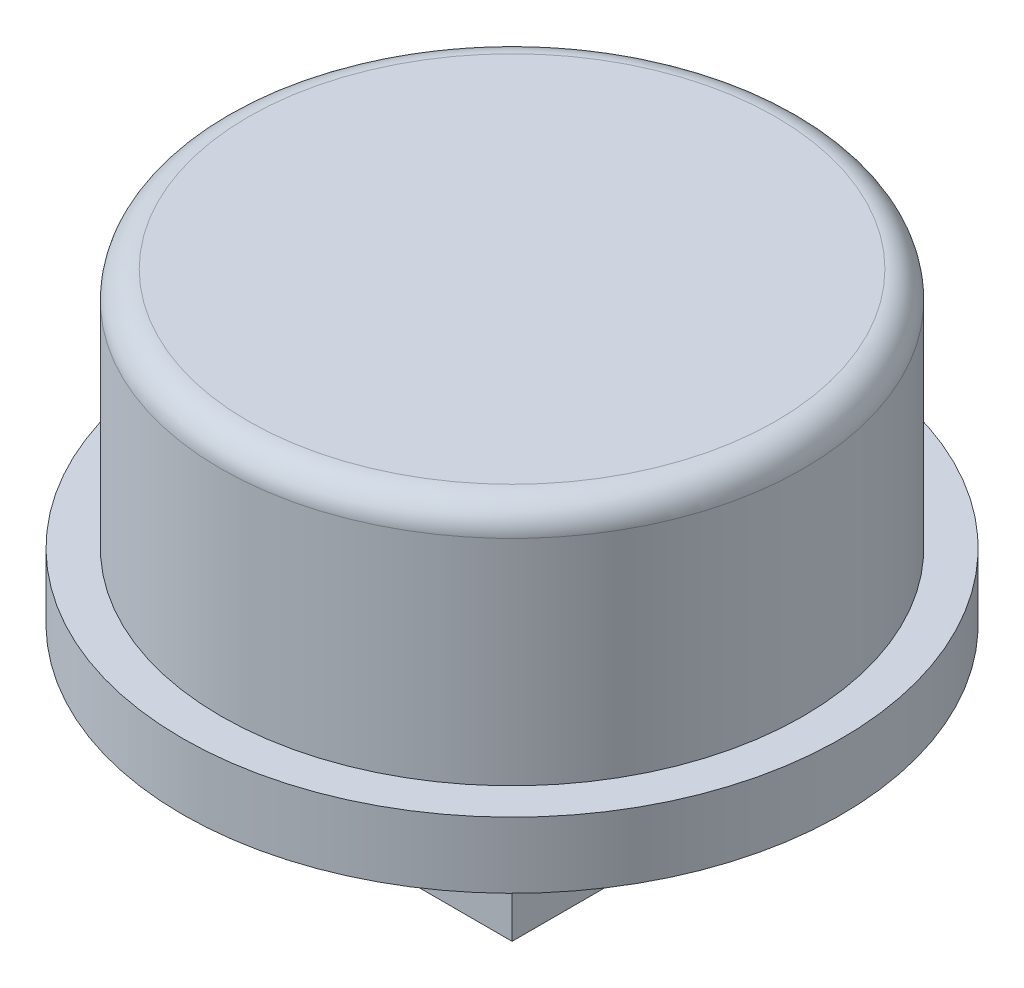
ISO-10303-21;
HEADER;
FILE_DESCRIPTION(('STEP AP214'),'2;1');
FILE_NAME('part.step','',(''),(''),'','','');
FILE_SCHEMA(('AUTOMOTIVE_DESIGN { 1 0 10303 214 1 1 1 1 }'));
ENDSEC;
DATA;
#1=APPLICATION_CONTEXT('core data for automotive mechanical design processes');
#2=APPLICATION_PROTOCOL_DEFINITION('international standard','automotive_design',2000,#1);
#3=PRODUCT_CONTEXT('',#1,'mechanical');
#4=PRODUCT('Part','Part','',(#3));
#5=PRODUCT_RELATED_PRODUCT_CATEGORY('part','',(#4));
#6=PRODUCT_DEFINITION_FORMATION('','',#4);
#7=PRODUCT_DEFINITION_CONTEXT('part definition',#1,'design');
#8=PRODUCT_DEFINITION('design','',#6,#7);
#9=PRODUCT_DEFINITION_SHAPE('','',#8);
#10=(LENGTH_UNIT() NAMED_UNIT(*) SI_UNIT(.MILLI.,.METRE.));
#11=(NAMED_UNIT(*) PLANE_ANGLE_UNIT() SI_UNIT($,.RADIAN.));
#12=(NAMED_UNIT(*) SI_UNIT($,.STERADIAN.) SOLID_ANGLE_UNIT());
#13=UNCERTAINTY_MEASURE_WITH_UNIT(LENGTH_MEASURE(1.E-05),#10,'distance_accuracy_value','');
#14=(GEOMETRIC_REPRESENTATION_CONTEXT(3) GLOBAL_UNCERTAINTY_ASSIGNED_CONTEXT((#13)) GLOBAL_UNIT_ASSIGNED_CONTEXT((#10,
#11,#12)) REPRESENTATION_CONTEXT('',''));
#15=CARTESIAN_POINT('',(0.,0.,0.));
#16=DIRECTION('',(0.,0.,1.));
#17=DIRECTION('',(1.,0.,0.));
#18=AXIS2_PLACEMENT_3D('',#15,#16,#17);
#19=CARTESIAN_POINT('',(0.,0.,0.));
#20=DIRECTION('',(0.,1.,0.));
#21=DIRECTION('',(0.,0.,1.));
#22=AXIS2_PLACEMENT_3D('',#19,#20,#21);
#23=PLANE('',#22);
#24=CARTESIAN_POINT('',(0.,0.,0.));
#25=DIRECTION('',(0.,1.,0.));
#26=DIRECTION('',(0.,0.,1.));
#27=AXIS2_PLACEMENT_3D('',#24,#25,#26);
#28=CIRCLE('',#27,6.);
#29=CARTESIAN_POINT('',(0.,0.,6.));
#30=VERTEX_POINT('',#29);
#31=EDGE_CURVE('E209',#30,#30,#28,.T.);
#32=ORIENTED_EDGE('',*,*,#31,.F.);
#33=EDGE_LOOP('',(#32));
#34=FACE_BOUND('',#33,.T.);
#35=DIRECTION('',(0.,0.,1.));
#36=VECTOR('',#35,1.);
#37=CARTESIAN_POINT('',(2.5,0.,-2.5));
#38=LINE('',#37,#36);
#39=CARTESIAN_POINT('',(2.5,0.,-2.5));
#40=VERTEX_POINT('',#39);
#41=CARTESIAN_POINT('',(2.5,0.,2.5));
#42=VERTEX_POINT('',#41);
#43=EDGE_CURVE('E128',#40,#42,#38,.T.);
#44=ORIENTED_EDGE('',*,*,#43,.F.);
#45=DIRECTION('',(1.,0.,0.));
#46=VECTOR('',#45,1.);
#47=CARTESIAN_POINT('',(-2.5,0.,-2.5));
#48=LINE('',#47,#46);
#49=CARTESIAN_POINT('',(-2.5,0.,-2.5));
#50=VERTEX_POINT('',#49);
#51=EDGE_CURVE('E167',#50,#40,#48,.T.);
#52=ORIENTED_EDGE('',*,*,#51,.F.);
#53=DIRECTION('',(0.,0.,-1.));
#54=VECTOR('',#53,1.);
#55=CARTESIAN_POINT('',(-2.5,0.,-2.5));
#56=LINE('',#55,#54);
#57=CARTESIAN_POINT('',(-2.5,0.,2.5));
#58=VERTEX_POINT('',#57);
#59=EDGE_CURVE('E64',#58,#50,#56,.T.);
#60=ORIENTED_EDGE('',*,*,#59,.F.);
#61=DIRECTION('',(-1.,0.,0.));
#62=VECTOR('',#61,1.);
#63=CARTESIAN_POINT('',(-2.5,0.,2.5));
#64=LINE('',#63,#62);
#65=EDGE_CURVE('E59',#42,#58,#64,.T.);
#66=ORIENTED_EDGE('',*,*,#65,.F.);
#67=EDGE_LOOP('',(#44,#52,#60,#66));
#68=FACE_BOUND('',#67,.T.);
#69=ADVANCED_FACE('F43',(#34,#68),#23,.F.);
#70=CARTESIAN_POINT('',(0.,5.6,0.));
#71=DIRECTION('',(0.,-1.,0.));
#72=DIRECTION('',(0.,0.,-1.));
#73=AXIS2_PLACEMENT_3D('',#70,#71,#72);
#74=CYLINDRICAL_SURFACE('',#73,6.);
#75=ORIENTED_EDGE('',*,*,#31,.T.);
#76=EDGE_LOOP('',(#75));
#77=FACE_BOUND('',#76,.T.);
#78=CARTESIAN_POINT('',(0.,1.2,0.));
#79=DIRECTION('',(0.,1.,0.));
#80=DIRECTION('',(0.,0.,1.));
#81=AXIS2_PLACEMENT_3D('',#78,#79,#80);
#82=CIRCLE('',#81,6.);
#83=CARTESIAN_POINT('',(0.,1.2,6.));
#84=VERTEX_POINT('',#83);
#85=EDGE_CURVE('E205',#84,#84,#82,.T.);
#86=ORIENTED_EDGE('',*,*,#85,.F.);
#87=EDGE_LOOP('',(#86));
#88=FACE_BOUND('',#87,.T.);
#89=ADVANCED_FACE('F231',(#77,#88),#74,.T.);
#90=CARTESIAN_POINT('',(0.,1.2,0.));
#91=DIRECTION('',(0.,1.,0.));
#92=DIRECTION('',(0.,0.,1.));
#93=AXIS2_PLACEMENT_3D('',#90,#91,#92);
#94=PLANE('',#93);
#95=CARTESIAN_POINT('',(0.,1.2,0.));
#96=DIRECTION('',(0.,1.,0.));
#97=DIRECTION('',(0.,0.,1.));
#98=AXIS2_PLACEMENT_3D('',#95,#96,#97);
#99=CIRCLE('',#98,5.3);
#100=CARTESIAN_POINT('',(0.,1.2,5.3));
#101=VERTEX_POINT('',#100);
#102=EDGE_CURVE('E201',#101,#101,#99,.T.);
#103=ORIENTED_EDGE('',*,*,#102,.F.);
#104=EDGE_LOOP('',(#103));
#105=FACE_BOUND('',#104,.T.);
#106=ORIENTED_EDGE('',*,*,#85,.T.);
#107=EDGE_LOOP('',(#106));
#108=FACE_BOUND('',#107,.T.);
#109=ADVANCED_FACE('F238',(#105,#108),#94,.T.);
#110=CARTESIAN_POINT('',(0.,1.2,0.));
#111=DIRECTION('',(0.,1.,0.));
#112=DIRECTION('',(0.,0.,1.));
#113=AXIS2_PLACEMENT_3D('',#110,#111,#112);
#114=CYLINDRICAL_SURFACE('',#113,5.3);
#115=CARTESIAN_POINT('',(0.,5.1,0.));
#116=DIRECTION('',(0.,1.,0.));
#117=DIRECTION('',(0.,0.,1.));
#118=AXIS2_PLACEMENT_3D('',#115,#116,#117);
#119=CIRCLE('',#118,5.3);
#120=CARTESIAN_POINT('',(0.,5.1,5.3));
#121=VERTEX_POINT('',#120);
#122=EDGE_CURVE('E11',#121,#121,#119,.F.);
#123=ORIENTED_EDGE('',*,*,#122,.T.);
#124=EDGE_LOOP('',(#123));
#125=FACE_BOUND('',#124,.T.);
#126=ORIENTED_EDGE('',*,*,#102,.T.);
#127=EDGE_LOOP('',(#126));
#128=FACE_BOUND('',#127,.T.);
#129=ADVANCED_FACE('F227',(#125,#128),#114,.T.);
#130=CARTESIAN_POINT('',(0.,5.6,0.));
#131=DIRECTION('',(0.,1.,0.));
#132=DIRECTION('',(0.,0.,1.));
#133=AXIS2_PLACEMENT_3D('',#130,#131,#132);
#134=PLANE('',#133);
#135=CARTESIAN_POINT('',(0.,5.6,0.));
#136=DIRECTION('',(0.,1.,0.));
#137=DIRECTION('',(0.,0.,1.));
#138=AXIS2_PLACEMENT_3D('',#135,#136,#137);
#139=CIRCLE('',#138,4.8);
#140=CARTESIAN_POINT('',(0.,5.6,4.8));
#141=VERTEX_POINT('',#140);
#142=EDGE_CURVE('E52',#141,#141,#139,.T.);
#143=ORIENTED_EDGE('',*,*,#142,.T.);
#144=EDGE_LOOP('',(#143));
#145=FACE_BOUND('',#144,.T.);
#146=ADVANCED_FACE('F216',(#145),#134,.T.);
#147=CARTESIAN_POINT('',(0.,5.1,0.));
#148=DIRECTION('',(0.,1.,0.));
#149=DIRECTION('',(0.,0.,1.));
#150=AXIS2_PLACEMENT_3D('',#147,#148,#149);
#151=TOROIDAL_SURFACE('',#150,4.8,0.5);
#152=ORIENTED_EDGE('',*,*,#122,.F.);
#153=EDGE_LOOP('',(#152));
#154=FACE_BOUND('',#153,.T.);
#155=ORIENTED_EDGE('',*,*,#142,.F.);
#156=EDGE_LOOP('',(#155));
#157=FACE_BOUND('',#156,.T.);
#158=ADVANCED_FACE('F45',(#154,#157),#151,.T.);
#159=CARTESIAN_POINT('',(0.,-2.5,0.));
#160=DIRECTION('',(0.,1.,0.));
#161=DIRECTION('',(0.,0.,1.));
#162=AXIS2_PLACEMENT_3D('',#159,#160,#161);
#163=PLANE('',#162);
#164=DIRECTION('',(0.,0.,1.));
#165=VECTOR('',#164,1.);
#166=CARTESIAN_POINT('',(2.5,-2.5,-2.5));
#167=LINE('',#166,#165);
#168=CARTESIAN_POINT('',(2.5,-2.5,-2.5));
#169=VERTEX_POINT('',#168);
#170=CARTESIAN_POINT('',(2.5,-2.5,2.5));
#171=VERTEX_POINT('',#170);
#172=EDGE_CURVE('E162',#169,#171,#167,.T.);
#173=ORIENTED_EDGE('',*,*,#172,.T.);
#174=DIRECTION('',(-1.,0.,0.));
#175=VECTOR('',#174,1.);
#176=CARTESIAN_POINT('',(-2.5,-2.5,2.5));
#177=LINE('',#176,#175);
#178=CARTESIAN_POINT('',(-2.5,-2.5,2.5));
#179=VERTEX_POINT('',#178);
#180=EDGE_CURVE('E166',#171,#179,#177,.T.);
#181=ORIENTED_EDGE('',*,*,#180,.T.);
#182=DIRECTION('',(0.,0.,-1.));
#183=VECTOR('',#182,1.);
#184=CARTESIAN_POINT('',(-2.5,-2.5,-2.5));
#185=LINE('',#184,#183);
#186=CARTESIAN_POINT('',(-2.5,-2.5,-2.5));
#187=VERTEX_POINT('',#186);
#188=EDGE_CURVE('E170',#179,#187,#185,.T.);
#189=ORIENTED_EDGE('',*,*,#188,.T.);
#190=DIRECTION('',(1.,0.,0.));
#191=VECTOR('',#190,1.);
#192=CARTESIAN_POINT('',(-2.5,-2.5,-2.5));
#193=LINE('',#192,#191);
#194=EDGE_CURVE('E173',#187,#169,#193,.T.);
#195=ORIENTED_EDGE('',*,*,#194,.T.);
#196=EDGE_LOOP('',(#173,#181,#189,#195));
#197=FACE_BOUND('',#196,.T.);
#198=DIRECTION('',(0.,0.,1.));
#199=VECTOR('',#198,1.);
#200=CARTESIAN_POINT('',(2.,-2.5,-2.));
#201=LINE('',#200,#199);
#202=CARTESIAN_POINT('',(2.,-2.5,-2.));
#203=VERTEX_POINT('',#202);
#204=CARTESIAN_POINT('',(2.,-2.5,2.));
#205=VERTEX_POINT('',#204);
#206=EDGE_CURVE('E108',#203,#205,#201,.T.);
#207=ORIENTED_EDGE('',*,*,#206,.F.);
#208=DIRECTION('',(1.,0.,0.));
#209=VECTOR('',#208,1.);
#210=CARTESIAN_POINT('',(-2.,-2.5,-2.));
#211=LINE('',#210,#209);
#212=CARTESIAN_POINT('',(-2.,-2.5,-2.));
#213=VERTEX_POINT('',#212);
#214=EDGE_CURVE('E138',#213,#203,#211,.T.);
#215=ORIENTED_EDGE('',*,*,#214,.F.);
#216=DIRECTION('',(0.,0.,-1.));
#217=VECTOR('',#216,1.);
#218=CARTESIAN_POINT('',(-2.,-2.5,-2.));
#219=LINE('',#218,#217);
#220=CARTESIAN_POINT('',(-2.,-2.5,2.));
#221=VERTEX_POINT('',#220);
#222=EDGE_CURVE('E134',#221,#213,#219,.T.);
#223=ORIENTED_EDGE('',*,*,#222,.F.);
#224=DIRECTION('',(-1.,0.,0.));
#225=VECTOR('',#224,1.);
#226=CARTESIAN_POINT('',(-2.,-2.5,2.));
#227=LINE('',#226,#225);
#228=EDGE_CURVE('E119',#205,#221,#227,.T.);
#229=ORIENTED_EDGE('',*,*,#228,.F.);
#230=EDGE_LOOP('',(#207,#215,#223,#229));
#231=FACE_BOUND('',#230,.T.);
#232=ADVANCED_FACE('F132',(#197,#231),#163,.F.);
#233=CARTESIAN_POINT('',(2.5,-2.5,-2.5));
#234=DIRECTION('',(-1.,0.,0.));
#235=DIRECTION('',(0.,0.,1.));
#236=AXIS2_PLACEMENT_3D('',#233,#234,#235);
#237=PLANE('',#236);
#238=ORIENTED_EDGE('',*,*,#43,.T.);
#239=DIRECTION('',(0.,1.,0.));
#240=VECTOR('',#239,1.);
#241=CARTESIAN_POINT('',(2.5,-2.5,2.5));
#242=LINE('',#241,#240);
#243=EDGE_CURVE('E198',#171,#42,#242,.T.);
#244=ORIENTED_EDGE('',*,*,#243,.F.);
#245=ORIENTED_EDGE('',*,*,#172,.F.);
#246=DIRECTION('',(0.,1.,0.));
#247=VECTOR('',#246,1.);
#248=CARTESIAN_POINT('',(2.5,-2.5,-2.5));
#249=LINE('',#248,#247);
#250=EDGE_CURVE('E176',#169,#40,#249,.T.);
#251=ORIENTED_EDGE('',*,*,#250,.T.);
#252=EDGE_LOOP('',(#238,#244,#245,#251));
#253=FACE_BOUND('',#252,.T.);
#254=ADVANCED_FACE('F224',(#253),#237,.F.);
#255=CARTESIAN_POINT('',(-2.5,-2.5,2.5));
#256=DIRECTION('',(0.,0.,-1.));
#257=DIRECTION('',(-1.,0.,0.));
#258=AXIS2_PLACEMENT_3D('',#255,#256,#257);
#259=PLANE('',#258);
#260=ORIENTED_EDGE('',*,*,#65,.T.);
#261=DIRECTION('',(0.,1.,0.));
#262=VECTOR('',#261,1.);
#263=CARTESIAN_POINT('',(-2.5,-2.5,2.5));
#264=LINE('',#263,#262);
#265=EDGE_CURVE('E194',#179,#58,#264,.T.);
#266=ORIENTED_EDGE('',*,*,#265,.F.);
#267=ORIENTED_EDGE('',*,*,#180,.F.);
#268=ORIENTED_EDGE('',*,*,#243,.T.);
#269=EDGE_LOOP('',(#260,#266,#267,#268));
#270=FACE_BOUND('',#269,.T.);
#271=ADVANCED_FACE('F269',(#270),#259,.F.);
#272=CARTESIAN_POINT('',(-2.5,-2.5,-2.5));
#273=DIRECTION('',(1.,0.,0.));
#274=DIRECTION('',(0.,0.,-1.));
#275=AXIS2_PLACEMENT_3D('',#272,#273,#274);
#276=PLANE('',#275);
#277=ORIENTED_EDGE('',*,*,#59,.T.);
#278=DIRECTION('',(0.,1.,0.));
#279=VECTOR('',#278,1.);
#280=CARTESIAN_POINT('',(-2.5,-2.5,-2.5));
#281=LINE('',#280,#279);
#282=EDGE_CURVE('E190',#187,#50,#281,.T.);
#283=ORIENTED_EDGE('',*,*,#282,.F.);
#284=ORIENTED_EDGE('',*,*,#188,.F.);
#285=ORIENTED_EDGE('',*,*,#265,.T.);
#286=EDGE_LOOP('',(#277,#283,#284,#285));
#287=FACE_BOUND('',#286,.T.);
#288=ADVANCED_FACE('F265',(#287),#276,.F.);
#289=CARTESIAN_POINT('',(-2.5,-2.5,-2.5));
#290=DIRECTION('',(0.,0.,1.));
#291=DIRECTION('',(1.,0.,0.));
#292=AXIS2_PLACEMENT_3D('',#289,#290,#291);
#293=PLANE('',#292);
#294=ORIENTED_EDGE('',*,*,#51,.T.);
#295=ORIENTED_EDGE('',*,*,#250,.F.);
#296=ORIENTED_EDGE('',*,*,#194,.F.);
#297=ORIENTED_EDGE('',*,*,#282,.T.);
#298=EDGE_LOOP('',(#294,#295,#296,#297));
#299=FACE_BOUND('',#298,.T.);
#300=ADVANCED_FACE('F261',(#299),#293,.F.);
#301=CARTESIAN_POINT('',(2.,-2.5,-2.));
#302=DIRECTION('',(-1.,0.,0.));
#303=DIRECTION('',(0.,0.,1.));
#304=AXIS2_PLACEMENT_3D('',#301,#302,#303);
#305=PLANE('',#304);
#306=DIRECTION('',(0.,0.,1.));
#307=VECTOR('',#306,1.);
#308=CARTESIAN_POINT('',(2.,0.,-2.));
#309=LINE('',#308,#307);
#310=CARTESIAN_POINT('',(2.,0.,-2.));
#311=VERTEX_POINT('',#310);
#312=CARTESIAN_POINT('',(2.,0.,2.));
#313=VERTEX_POINT('',#312);
#314=EDGE_CURVE('E143',#311,#313,#309,.T.);
#315=ORIENTED_EDGE('',*,*,#314,.F.);
#316=DIRECTION('',(0.,1.,0.));
#317=VECTOR('',#316,1.);
#318=CARTESIAN_POINT('',(2.,-2.5,-2.));
#319=LINE('',#318,#317);
#320=EDGE_CURVE('E114',#203,#311,#319,.T.);
#321=ORIENTED_EDGE('',*,*,#320,.F.);
#322=ORIENTED_EDGE('',*,*,#206,.T.);
#323=DIRECTION('',(0.,1.,0.));
#324=VECTOR('',#323,1.);
#325=CARTESIAN_POINT('',(2.,-2.5,2.));
#326=LINE('',#325,#324);
#327=EDGE_CURVE('E112',#205,#313,#326,.T.);
#328=ORIENTED_EDGE('',*,*,#327,.T.);
#329=EDGE_LOOP('',(#315,#321,#322,#328));
#330=FACE_BOUND('',#329,.T.);
#331=ADVANCED_FACE('F111',(#330),#305,.T.);
#332=CARTESIAN_POINT('',(-2.,-2.5,2.));
#333=DIRECTION('',(0.,0.,-1.));
#334=DIRECTION('',(-1.,0.,0.));
#335=AXIS2_PLACEMENT_3D('',#332,#333,#334);
#336=PLANE('',#335);
#337=DIRECTION('',(-1.,0.,0.));
#338=VECTOR('',#337,1.);
#339=CARTESIAN_POINT('',(-2.,0.,2.));
#340=LINE('',#339,#338);
#341=CARTESIAN_POINT('',(-2.,0.,2.));
#342=VERTEX_POINT('',#341);
#343=EDGE_CURVE('E126',#313,#342,#340,.T.);
#344=ORIENTED_EDGE('',*,*,#343,.F.);
#345=ORIENTED_EDGE('',*,*,#327,.F.);
#346=ORIENTED_EDGE('',*,*,#228,.T.);
#347=DIRECTION('',(0.,1.,0.));
#348=VECTOR('',#347,1.);
#349=CARTESIAN_POINT('',(-2.,-2.5,2.));
#350=LINE('',#349,#348);
#351=EDGE_CURVE('E129',#221,#342,#350,.T.);
#352=ORIENTED_EDGE('',*,*,#351,.T.);
#353=EDGE_LOOP('',(#344,#345,#346,#352));
#354=FACE_BOUND('',#353,.T.);
#355=ADVANCED_FACE('F123',(#354),#336,.T.);
#356=CARTESIAN_POINT('',(-2.,-2.5,-2.));
#357=DIRECTION('',(1.,0.,0.));
#358=DIRECTION('',(0.,0.,-1.));
#359=AXIS2_PLACEMENT_3D('',#356,#357,#358);
#360=PLANE('',#359);
#361=DIRECTION('',(0.,0.,-1.));
#362=VECTOR('',#361,1.);
#363=CARTESIAN_POINT('',(-2.,0.,-2.));
#364=LINE('',#363,#362);
#365=CARTESIAN_POINT('',(-2.,0.,-2.));
#366=VERTEX_POINT('',#365);
#367=EDGE_CURVE('E148',#342,#366,#364,.T.);
#368=ORIENTED_EDGE('',*,*,#367,.F.);
#369=ORIENTED_EDGE('',*,*,#351,.F.);
#370=ORIENTED_EDGE('',*,*,#222,.T.);
#371=DIRECTION('',(0.,1.,0.));
#372=VECTOR('',#371,1.);
#373=CARTESIAN_POINT('',(-2.,-2.5,-2.));
#374=LINE('',#373,#372);
#375=EDGE_CURVE('E157',#213,#366,#374,.T.);
#376=ORIENTED_EDGE('',*,*,#375,.T.);
#377=EDGE_LOOP('',(#368,#369,#370,#376));
#378=FACE_BOUND('',#377,.T.);
#379=ADVANCED_FACE('F247',(#378),#360,.T.);
#380=CARTESIAN_POINT('',(-2.,-2.5,-2.));
#381=DIRECTION('',(0.,0.,1.));
#382=DIRECTION('',(1.,0.,0.));
#383=AXIS2_PLACEMENT_3D('',#380,#381,#382);
#384=PLANE('',#383);
#385=DIRECTION('',(1.,0.,0.));
#386=VECTOR('',#385,1.);
#387=CARTESIAN_POINT('',(-2.,0.,-2.));
#388=LINE('',#387,#386);
#389=EDGE_CURVE('E120',#366,#311,#388,.T.);
#390=ORIENTED_EDGE('',*,*,#389,.F.);
#391=ORIENTED_EDGE('',*,*,#375,.F.);
#392=ORIENTED_EDGE('',*,*,#214,.T.);
#393=ORIENTED_EDGE('',*,*,#320,.T.);
#394=EDGE_LOOP('',(#390,#391,#392,#393));
#395=FACE_BOUND('',#394,.T.);
#396=ADVANCED_FACE('F242',(#395),#384,.T.);
#397=ORIENTED_EDGE('',*,*,#389,.T.);
#398=ORIENTED_EDGE('',*,*,#314,.T.);
#399=ORIENTED_EDGE('',*,*,#343,.T.);
#400=ORIENTED_EDGE('',*,*,#367,.T.);
#401=EDGE_LOOP('',(#397,#398,#399,#400));
#402=FACE_BOUND('',#401,.T.);
#403=ADVANCED_FACE('F234',(#402),#23,.F.);
#404=CLOSED_SHELL('',(#69,#89,#109,#129,#146,#158,#232,#254,#271,#288,#300,#331,#355,#379,#396,#403));
#405=MANIFOLD_SOLID_BREP('B2',#404);
#406=ADVANCED_BREP_SHAPE_REPRESENTATION('',(#18,#405),#14);
#407=SHAPE_DEFINITION_REPRESENTATION(#9,#406);
ENDSEC;
END-ISO-10303-21;
